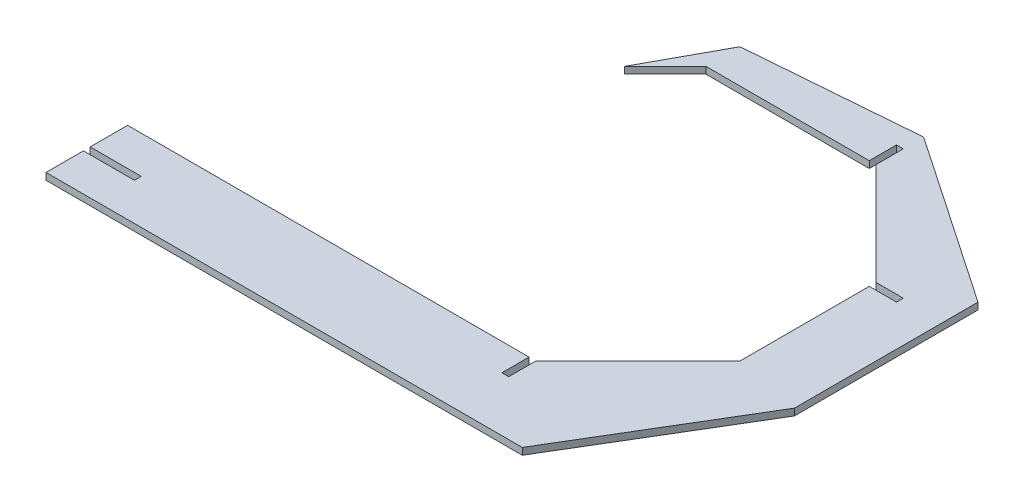
ISO-10303-21;
HEADER;
FILE_DESCRIPTION(('STEP AP214'),'2;1');
FILE_NAME('part.step','',(''),(''),'','','');
FILE_SCHEMA(('AUTOMOTIVE_DESIGN { 1 0 10303 214 1 1 1 1 }'));
ENDSEC;
DATA;
#1=APPLICATION_CONTEXT('core data for automotive mechanical design processes');
#2=APPLICATION_PROTOCOL_DEFINITION('international standard','automotive_design',2000,#1);
#3=PRODUCT_CONTEXT('',#1,'mechanical');
#4=PRODUCT('Part','Part','',(#3));
#5=PRODUCT_RELATED_PRODUCT_CATEGORY('part','',(#4));
#6=PRODUCT_DEFINITION_FORMATION('','',#4);
#7=PRODUCT_DEFINITION_CONTEXT('part definition',#1,'design');
#8=PRODUCT_DEFINITION('design','',#6,#7);
#9=PRODUCT_DEFINITION_SHAPE('','',#8);
#10=(LENGTH_UNIT() NAMED_UNIT(*) SI_UNIT(.MILLI.,.METRE.));
#11=(NAMED_UNIT(*) PLANE_ANGLE_UNIT() SI_UNIT($,.RADIAN.));
#12=(NAMED_UNIT(*) SI_UNIT($,.STERADIAN.) SOLID_ANGLE_UNIT());
#13=UNCERTAINTY_MEASURE_WITH_UNIT(LENGTH_MEASURE(1.E-05),#10,'distance_accuracy_value','');
#14=(GEOMETRIC_REPRESENTATION_CONTEXT(3) GLOBAL_UNCERTAINTY_ASSIGNED_CONTEXT((#13)) GLOBAL_UNIT_ASSIGNED_CONTEXT((#10,
#11,#12)) REPRESENTATION_CONTEXT('',''));
#15=CARTESIAN_POINT('',(0.,0.,0.));
#16=DIRECTION('',(0.,0.,1.));
#17=DIRECTION('',(1.,0.,0.));
#18=AXIS2_PLACEMENT_3D('',#15,#16,#17);
#19=CARTESIAN_POINT('',(0.,2.54,0.));
#20=DIRECTION('',(1.,0.,0.));
#21=DIRECTION('',(0.,0.,-1.));
#22=AXIS2_PLACEMENT_3D('',#19,#20,#21);
#23=PLANE('',#22);
#24=DIRECTION('',(0.,0.,1.));
#25=VECTOR('',#24,1.);
#26=CARTESIAN_POINT('',(0.,0.,0.));
#27=LINE('',#26,#25);
#28=CARTESIAN_POINT('',(0.,0.,0.));
#29=VERTEX_POINT('',#28);
#30=CARTESIAN_POINT('',(0.,0.,13.97));
#31=VERTEX_POINT('',#30);
#32=EDGE_CURVE('E345',#29,#31,#27,.T.);
#33=ORIENTED_EDGE('',*,*,#32,.T.);
#34=DIRECTION('',(0.,1.,0.));
#35=VECTOR('',#34,1.);
#36=CARTESIAN_POINT('',(0.,0.,13.97));
#37=LINE('',#36,#35);
#38=CARTESIAN_POINT('',(0.,2.54,13.97));
#39=VERTEX_POINT('',#38);
#40=EDGE_CURVE('E301',#31,#39,#37,.T.);
#41=ORIENTED_EDGE('',*,*,#40,.T.);
#42=DIRECTION('',(0.,0.,1.));
#43=VECTOR('',#42,1.);
#44=CARTESIAN_POINT('',(0.,2.54,0.));
#45=LINE('',#44,#43);
#46=CARTESIAN_POINT('',(0.,2.54,0.));
#47=VERTEX_POINT('',#46);
#48=EDGE_CURVE('E314',#47,#39,#45,.T.);
#49=ORIENTED_EDGE('',*,*,#48,.F.);
#50=DIRECTION('',(0.,-1.,0.));
#51=VECTOR('',#50,1.);
#52=CARTESIAN_POINT('',(0.,2.54,0.));
#53=LINE('',#52,#51);
#54=EDGE_CURVE('E11',#47,#29,#53,.T.);
#55=ORIENTED_EDGE('',*,*,#54,.T.);
#56=EDGE_LOOP('',(#33,#41,#49,#55));
#57=FACE_BOUND('',#56,.T.);
#58=ADVANCED_FACE('F33',(#57),#23,.F.);
#59=CARTESIAN_POINT('',(0.,2.54,0.));
#60=DIRECTION('',(0.,0.,1.));
#61=DIRECTION('',(1.,0.,0.));
#62=AXIS2_PLACEMENT_3D('',#59,#60,#61);
#63=PLANE('',#62);
#64=DIRECTION('',(-1.,0.,0.));
#65=VECTOR('',#64,1.);
#66=CARTESIAN_POINT('',(0.,2.54,0.));
#67=LINE('',#66,#65);
#68=CARTESIAN_POINT('',(149.86,2.54,0.));
#69=VERTEX_POINT('',#68);
#70=EDGE_CURVE('E310',#69,#47,#67,.T.);
#71=ORIENTED_EDGE('',*,*,#70,.F.);
#72=DIRECTION('',(0.,1.,0.));
#73=VECTOR('',#72,1.);
#74=CARTESIAN_POINT('',(149.86,0.,0.));
#75=LINE('',#74,#73);
#76=CARTESIAN_POINT('',(149.86,0.,0.));
#77=VERTEX_POINT('',#76);
#78=EDGE_CURVE('E271',#77,#69,#75,.T.);
#79=ORIENTED_EDGE('',*,*,#78,.F.);
#80=DIRECTION('',(-1.,0.,0.));
#81=VECTOR('',#80,1.);
#82=CARTESIAN_POINT('',(0.,0.,0.));
#83=LINE('',#82,#81);
#84=EDGE_CURVE('E304',#77,#29,#83,.T.);
#85=ORIENTED_EDGE('',*,*,#84,.T.);
#86=ORIENTED_EDGE('',*,*,#54,.F.);
#87=EDGE_LOOP('',(#71,#79,#85,#86));
#88=FACE_BOUND('',#87,.T.);
#89=ADVANCED_FACE('F35',(#88),#63,.F.);
#90=CARTESIAN_POINT('',(0.,2.54,16.51));
#91=VERTEX_POINT('',#90);
#92=CARTESIAN_POINT('',(0.,2.54,30.48));
#93=VERTEX_POINT('',#92);
#94=EDGE_CURVE('E312',#91,#93,#45,.T.);
#95=ORIENTED_EDGE('',*,*,#94,.F.);
#96=DIRECTION('',(0.,1.,0.));
#97=VECTOR('',#96,1.);
#98=CARTESIAN_POINT('',(0.,0.,16.51));
#99=LINE('',#98,#97);
#100=CARTESIAN_POINT('',(0.,0.,16.51));
#101=VERTEX_POINT('',#100);
#102=EDGE_CURVE('E294',#101,#91,#99,.T.);
#103=ORIENTED_EDGE('',*,*,#102,.F.);
#104=CARTESIAN_POINT('',(0.,0.,30.48));
#105=VERTEX_POINT('',#104);
#106=EDGE_CURVE('E344',#101,#105,#27,.T.);
#107=ORIENTED_EDGE('',*,*,#106,.T.);
#108=DIRECTION('',(0.,-1.,0.));
#109=VECTOR('',#108,1.);
#110=CARTESIAN_POINT('',(0.,2.54,30.48));
#111=LINE('',#110,#109);
#112=EDGE_CURVE('E41',#93,#105,#111,.T.);
#113=ORIENTED_EDGE('',*,*,#112,.F.);
#114=EDGE_LOOP('',(#95,#103,#107,#113));
#115=FACE_BOUND('',#114,.T.);
#116=ADVANCED_FACE('F426',(#115),#23,.F.);
#117=CARTESIAN_POINT('',(0.,2.54,30.48));
#118=DIRECTION('',(0.,0.,-1.));
#119=DIRECTION('',(-1.,0.,0.));
#120=AXIS2_PLACEMENT_3D('',#117,#118,#119);
#121=PLANE('',#120);
#122=DIRECTION('',(1.,0.,0.));
#123=VECTOR('',#122,1.);
#124=CARTESIAN_POINT('',(0.,0.,30.48));
#125=LINE('',#124,#123);
#126=CARTESIAN_POINT('',(177.8,0.,30.48));
#127=VERTEX_POINT('',#126);
#128=EDGE_CURVE('E348',#105,#127,#125,.T.);
#129=ORIENTED_EDGE('',*,*,#128,.T.);
#130=DIRECTION('',(0.,-1.,0.));
#131=VECTOR('',#130,1.);
#132=CARTESIAN_POINT('',(177.8,2.54,30.48));
#133=LINE('',#132,#131);
#134=CARTESIAN_POINT('',(177.8,2.54,30.48));
#135=VERTEX_POINT('',#134);
#136=EDGE_CURVE('E396',#135,#127,#133,.T.);
#137=ORIENTED_EDGE('',*,*,#136,.F.);
#138=DIRECTION('',(1.,0.,0.));
#139=VECTOR('',#138,1.);
#140=CARTESIAN_POINT('',(0.,2.54,30.48));
#141=LINE('',#140,#139);
#142=EDGE_CURVE('E317',#93,#135,#141,.T.);
#143=ORIENTED_EDGE('',*,*,#142,.F.);
#144=ORIENTED_EDGE('',*,*,#112,.T.);
#145=EDGE_LOOP('',(#129,#137,#143,#144));
#146=FACE_BOUND('',#145,.T.);
#147=ADVANCED_FACE('F403',(#146),#121,.F.);
#148=CARTESIAN_POINT('',(215.9,2.54,-33.02));
#149=DIRECTION('',(-0.857492925712544,0.,-0.514495755427526));
#150=DIRECTION('',(-0.514495755427526,0.,0.857492925712544));
#151=AXIS2_PLACEMENT_3D('',#148,#149,#150);
#152=PLANE('',#151);
#153=DIRECTION('',(0.514495755427526,0.,-0.857492925712544));
#154=VECTOR('',#153,1.);
#155=CARTESIAN_POINT('',(215.9,0.,-33.02));
#156=LINE('',#155,#154);
#157=CARTESIAN_POINT('',(215.9,0.,-33.02));
#158=VERTEX_POINT('',#157);
#159=EDGE_CURVE('E350',#127,#158,#156,.T.);
#160=ORIENTED_EDGE('',*,*,#159,.T.);
#161=DIRECTION('',(0.,-1.,0.));
#162=VECTOR('',#161,1.);
#163=CARTESIAN_POINT('',(215.9,2.54,-33.02));
#164=LINE('',#163,#162);
#165=CARTESIAN_POINT('',(215.9,2.54,-33.02));
#166=VERTEX_POINT('',#165);
#167=EDGE_CURVE('E393',#166,#158,#164,.T.);
#168=ORIENTED_EDGE('',*,*,#167,.F.);
#169=DIRECTION('',(0.514495755427526,0.,-0.857492925712544));
#170=VECTOR('',#169,1.);
#171=CARTESIAN_POINT('',(215.9,2.54,-33.02));
#172=LINE('',#171,#170);
#173=EDGE_CURVE('E319',#135,#166,#172,.T.);
#174=ORIENTED_EDGE('',*,*,#173,.F.);
#175=ORIENTED_EDGE('',*,*,#136,.T.);
#176=EDGE_LOOP('',(#160,#168,#174,#175));
#177=FACE_BOUND('',#176,.T.);
#178=ADVANCED_FACE('F413',(#177),#152,.F.);
#179=CARTESIAN_POINT('',(215.9,2.54,-101.555269232689));
#180=DIRECTION('',(-1.,0.,0.));
#181=DIRECTION('',(0.,0.,1.));
#182=AXIS2_PLACEMENT_3D('',#179,#180,#181);
#183=PLANE('',#182);
#184=DIRECTION('',(0.,0.,-1.));
#185=VECTOR('',#184,1.);
#186=CARTESIAN_POINT('',(215.9,0.,-101.555269232689));
#187=LINE('',#186,#185);
#188=CARTESIAN_POINT('',(215.9,0.,-101.555269232689));
#189=VERTEX_POINT('',#188);
#190=EDGE_CURVE('E352',#158,#189,#187,.T.);
#191=ORIENTED_EDGE('',*,*,#190,.T.);
#192=DIRECTION('',(0.,-1.,0.));
#193=VECTOR('',#192,1.);
#194=CARTESIAN_POINT('',(215.9,2.54,-101.555269232689));
#195=LINE('',#194,#193);
#196=CARTESIAN_POINT('',(215.9,2.54,-101.555269232689));
#197=VERTEX_POINT('',#196);
#198=EDGE_CURVE('E390',#197,#189,#195,.T.);
#199=ORIENTED_EDGE('',*,*,#198,.F.);
#200=DIRECTION('',(0.,0.,-1.));
#201=VECTOR('',#200,1.);
#202=CARTESIAN_POINT('',(215.9,2.54,-101.555269232689));
#203=LINE('',#202,#201);
#204=EDGE_CURVE('E321',#166,#197,#203,.T.);
#205=ORIENTED_EDGE('',*,*,#204,.F.);
#206=ORIENTED_EDGE('',*,*,#167,.T.);
#207=EDGE_LOOP('',(#191,#199,#205,#206));
#208=FACE_BOUND('',#207,.T.);
#209=ADVANCED_FACE('F417',(#208),#183,.F.);
#210=CARTESIAN_POINT('',(152.4,2.54,-144.78));
#211=DIRECTION('',(-0.562708146881539,0.,0.826655636545922));
#212=DIRECTION('',(0.826655636545922,0.,0.562708146881539));
#213=AXIS2_PLACEMENT_3D('',#210,#211,#212);
#214=PLANE('',#213);
#215=DIRECTION('',(-0.826655636545922,0.,-0.562708146881539));
#216=VECTOR('',#215,1.);
#217=CARTESIAN_POINT('',(152.4,0.,-144.78));
#218=LINE('',#217,#216);
#219=CARTESIAN_POINT('',(152.4,0.,-144.78));
#220=VERTEX_POINT('',#219);
#221=EDGE_CURVE('E354',#189,#220,#218,.T.);
#222=ORIENTED_EDGE('',*,*,#221,.T.);
#223=DIRECTION('',(0.,-1.,0.));
#224=VECTOR('',#223,1.);
#225=CARTESIAN_POINT('',(152.4,2.54,-144.78));
#226=LINE('',#225,#224);
#227=CARTESIAN_POINT('',(152.4,2.54,-144.78));
#228=VERTEX_POINT('',#227);
#229=EDGE_CURVE('E387',#228,#220,#226,.T.);
#230=ORIENTED_EDGE('',*,*,#229,.F.);
#231=DIRECTION('',(-0.826655636545922,0.,-0.562708146881539));
#232=VECTOR('',#231,1.);
#233=CARTESIAN_POINT('',(152.4,2.54,-144.78));
#234=LINE('',#233,#232);
#235=EDGE_CURVE('E323',#197,#228,#234,.T.);
#236=ORIENTED_EDGE('',*,*,#235,.F.);
#237=ORIENTED_EDGE('',*,*,#198,.T.);
#238=EDGE_LOOP('',(#222,#230,#236,#237));
#239=FACE_BOUND('',#238,.T.);
#240=ADVANCED_FACE('F501',(#239),#214,.F.);
#241=CARTESIAN_POINT('',(88.9,2.54,-139.7));
#242=DIRECTION('',(0.07974522228289,0.,0.996815278536125));
#243=DIRECTION('',(0.996815278536125,0.,-0.07974522228289));
#244=AXIS2_PLACEMENT_3D('',#241,#242,#243);
#245=PLANE('',#244);
#246=DIRECTION('',(-0.996815278536125,0.,0.07974522228289));
#247=VECTOR('',#246,1.);
#248=CARTESIAN_POINT('',(88.9,0.,-139.7));
#249=LINE('',#248,#247);
#250=CARTESIAN_POINT('',(88.9,0.,-139.7));
#251=VERTEX_POINT('',#250);
#252=EDGE_CURVE('E356',#220,#251,#249,.T.);
#253=ORIENTED_EDGE('',*,*,#252,.T.);
#254=DIRECTION('',(0.,-1.,0.));
#255=VECTOR('',#254,1.);
#256=CARTESIAN_POINT('',(88.9,2.54,-139.7));
#257=LINE('',#256,#255);
#258=CARTESIAN_POINT('',(88.9,2.54,-139.7));
#259=VERTEX_POINT('',#258);
#260=EDGE_CURVE('E384',#259,#251,#257,.T.);
#261=ORIENTED_EDGE('',*,*,#260,.F.);
#262=DIRECTION('',(-0.996815278536125,0.,0.07974522228289));
#263=VECTOR('',#262,1.);
#264=CARTESIAN_POINT('',(88.9,2.54,-139.7));
#265=LINE('',#264,#263);
#266=EDGE_CURVE('E325',#228,#259,#265,.T.);
#267=ORIENTED_EDGE('',*,*,#266,.F.);
#268=ORIENTED_EDGE('',*,*,#229,.T.);
#269=EDGE_LOOP('',(#253,#261,#267,#268));
#270=FACE_BOUND('',#269,.T.);
#271=ADVANCED_FACE('F499',(#270),#245,.F.);
#272=CARTESIAN_POINT('',(73.66,2.54,-111.76));
#273=DIRECTION('',(0.877895572914384,0.,0.478852130680573));
#274=DIRECTION('',(0.478852130680573,0.,-0.877895572914385));
#275=AXIS2_PLACEMENT_3D('',#272,#273,#274);
#276=PLANE('',#275);
#277=DIRECTION('',(-0.478852130680573,0.,0.877895572914385));
#278=VECTOR('',#277,1.);
#279=CARTESIAN_POINT('',(73.66,0.,-111.76));
#280=LINE('',#279,#278);
#281=CARTESIAN_POINT('',(73.66,0.,-111.76));
#282=VERTEX_POINT('',#281);
#283=EDGE_CURVE('E358',#251,#282,#280,.T.);
#284=ORIENTED_EDGE('',*,*,#283,.T.);
#285=DIRECTION('',(0.,-1.,0.));
#286=VECTOR('',#285,1.);
#287=CARTESIAN_POINT('',(73.66,2.54,-111.76));
#288=LINE('',#287,#286);
#289=CARTESIAN_POINT('',(73.66,2.54,-111.76));
#290=VERTEX_POINT('',#289);
#291=EDGE_CURVE('E381',#290,#282,#288,.T.);
#292=ORIENTED_EDGE('',*,*,#291,.F.);
#293=DIRECTION('',(-0.478852130680573,0.,0.877895572914385));
#294=VECTOR('',#293,1.);
#295=CARTESIAN_POINT('',(73.66,2.54,-111.76));
#296=LINE('',#295,#294);
#297=EDGE_CURVE('E327',#259,#290,#296,.T.);
#298=ORIENTED_EDGE('',*,*,#297,.F.);
#299=ORIENTED_EDGE('',*,*,#260,.T.);
#300=EDGE_LOOP('',(#284,#292,#298,#299));
#301=FACE_BOUND('',#300,.T.);
#302=ADVANCED_FACE('F495',(#301),#276,.F.);
#303=CARTESIAN_POINT('',(88.9,2.54,-127.));
#304=DIRECTION('',(-0.707106781186548,0.,-0.707106781186547));
#305=DIRECTION('',(-0.707106781186547,0.,0.707106781186548));
#306=AXIS2_PLACEMENT_3D('',#303,#304,#305);
#307=PLANE('',#306);
#308=DIRECTION('',(0.707106781186547,0.,-0.707106781186549));
#309=VECTOR('',#308,1.);
#310=CARTESIAN_POINT('',(88.9,0.,-127.));
#311=LINE('',#310,#309);
#312=CARTESIAN_POINT('',(88.9,0.,-127.));
#313=VERTEX_POINT('',#312);
#314=EDGE_CURVE('E360',#282,#313,#311,.T.);
#315=ORIENTED_EDGE('',*,*,#314,.T.);
#316=DIRECTION('',(0.,-1.,0.));
#317=VECTOR('',#316,1.);
#318=CARTESIAN_POINT('',(88.9,2.54,-127.));
#319=LINE('',#318,#317);
#320=CARTESIAN_POINT('',(88.9,2.54,-127.));
#321=VERTEX_POINT('',#320);
#322=EDGE_CURVE('E378',#321,#313,#319,.T.);
#323=ORIENTED_EDGE('',*,*,#322,.F.);
#324=DIRECTION('',(0.707106781186547,0.,-0.707106781186549));
#325=VECTOR('',#324,1.);
#326=CARTESIAN_POINT('',(88.9,2.54,-127.));
#327=LINE('',#326,#325);
#328=EDGE_CURVE('E329',#290,#321,#327,.T.);
#329=ORIENTED_EDGE('',*,*,#328,.F.);
#330=ORIENTED_EDGE('',*,*,#291,.T.);
#331=EDGE_LOOP('',(#315,#323,#329,#330));
#332=FACE_BOUND('',#331,.T.);
#333=ADVANCED_FACE('F490',(#332),#307,.F.);
#334=CARTESIAN_POINT('',(152.4,2.54,-127.));
#335=DIRECTION('',(0.,0.,-1.));
#336=DIRECTION('',(-1.,0.,0.));
#337=AXIS2_PLACEMENT_3D('',#334,#335,#336);
#338=PLANE('',#337);
#339=DIRECTION('',(1.,0.,0.));
#340=VECTOR('',#339,1.);
#341=CARTESIAN_POINT('',(152.4,0.,-127.));
#342=LINE('',#341,#340);
#343=CARTESIAN_POINT('',(149.86,0.,-127.));
#344=VERTEX_POINT('',#343);
#345=EDGE_CURVE('E362',#313,#344,#342,.T.);
#346=ORIENTED_EDGE('',*,*,#345,.T.);
#347=DIRECTION('',(0.,1.,0.));
#348=VECTOR('',#347,1.);
#349=CARTESIAN_POINT('',(149.86,0.,-127.));
#350=LINE('',#349,#348);
#351=CARTESIAN_POINT('',(149.86,2.54,-127.));
#352=VERTEX_POINT('',#351);
#353=EDGE_CURVE('E236',#344,#352,#350,.T.);
#354=ORIENTED_EDGE('',*,*,#353,.T.);
#355=DIRECTION('',(1.,0.,0.));
#356=VECTOR('',#355,1.);
#357=CARTESIAN_POINT('',(152.4,2.54,-127.));
#358=LINE('',#357,#356);
#359=EDGE_CURVE('E331',#321,#352,#358,.T.);
#360=ORIENTED_EDGE('',*,*,#359,.F.);
#361=ORIENTED_EDGE('',*,*,#322,.T.);
#362=EDGE_LOOP('',(#346,#354,#360,#361));
#363=FACE_BOUND('',#362,.T.);
#364=ADVANCED_FACE('F483',(#363),#338,.F.);
#365=CARTESIAN_POINT('',(190.5,2.54,-88.9));
#366=DIRECTION('',(0.707106781186547,0.,-0.707106781186548));
#367=DIRECTION('',(-0.707106781186548,0.,-0.707106781186547));
#368=AXIS2_PLACEMENT_3D('',#365,#366,#367);
#369=PLANE('',#368);
#370=DIRECTION('',(0.707106781186548,0.,0.707106781186547));
#371=VECTOR('',#370,1.);
#372=CARTESIAN_POINT('',(190.5,0.,-88.9));
#373=LINE('',#372,#371);
#374=CARTESIAN_POINT('',(152.4,0.,-127.));
#375=VERTEX_POINT('',#374);
#376=CARTESIAN_POINT('',(190.5,0.,-88.9));
#377=VERTEX_POINT('',#376);
#378=EDGE_CURVE('E227',#375,#377,#373,.T.);
#379=ORIENTED_EDGE('',*,*,#378,.T.);
#380=DIRECTION('',(0.,-1.,0.));
#381=VECTOR('',#380,1.);
#382=CARTESIAN_POINT('',(190.5,2.54,-88.9));
#383=LINE('',#382,#381);
#384=CARTESIAN_POINT('',(190.5,2.54,-88.9));
#385=VERTEX_POINT('',#384);
#386=EDGE_CURVE('E374',#385,#377,#383,.T.);
#387=ORIENTED_EDGE('',*,*,#386,.F.);
#388=DIRECTION('',(0.707106781186548,0.,0.707106781186547));
#389=VECTOR('',#388,1.);
#390=CARTESIAN_POINT('',(190.5,2.54,-88.9));
#391=LINE('',#390,#389);
#392=CARTESIAN_POINT('',(152.4,2.54,-127.));
#393=VERTEX_POINT('',#392);
#394=EDGE_CURVE('E334',#393,#385,#391,.T.);
#395=ORIENTED_EDGE('',*,*,#394,.F.);
#396=DIRECTION('',(0.,-1.,0.));
#397=VECTOR('',#396,1.);
#398=CARTESIAN_POINT('',(152.4,2.54,-127.));
#399=LINE('',#398,#397);
#400=EDGE_CURVE('E376',#393,#375,#399,.T.);
#401=ORIENTED_EDGE('',*,*,#400,.T.);
#402=EDGE_LOOP('',(#379,#387,#395,#401));
#403=FACE_BOUND('',#402,.T.);
#404=ADVANCED_FACE('F478',(#403),#369,.F.);
#405=CARTESIAN_POINT('',(190.5,2.54,-38.1));
#406=DIRECTION('',(1.,0.,0.));
#407=DIRECTION('',(0.,0.,-1.));
#408=AXIS2_PLACEMENT_3D('',#405,#406,#407);
#409=PLANE('',#408);
#410=DIRECTION('',(0.,0.,1.));
#411=VECTOR('',#410,1.);
#412=CARTESIAN_POINT('',(190.5,2.54,-38.1));
#413=LINE('',#412,#411);
#414=CARTESIAN_POINT('',(190.5,2.54,-86.36));
#415=VERTEX_POINT('',#414);
#416=CARTESIAN_POINT('',(190.5,2.54,-38.1));
#417=VERTEX_POINT('',#416);
#418=EDGE_CURVE('E337',#415,#417,#413,.T.);
#419=ORIENTED_EDGE('',*,*,#418,.F.);
#420=DIRECTION('',(0.,1.,0.));
#421=VECTOR('',#420,1.);
#422=CARTESIAN_POINT('',(190.5,0.,-86.36));
#423=LINE('',#422,#421);
#424=CARTESIAN_POINT('',(190.5,0.,-86.36));
#425=VERTEX_POINT('',#424);
#426=EDGE_CURVE('E248',#425,#415,#423,.T.);
#427=ORIENTED_EDGE('',*,*,#426,.F.);
#428=DIRECTION('',(0.,0.,1.));
#429=VECTOR('',#428,1.);
#430=CARTESIAN_POINT('',(190.5,0.,-38.1));
#431=LINE('',#430,#429);
#432=CARTESIAN_POINT('',(190.5,0.,-38.1));
#433=VERTEX_POINT('',#432);
#434=EDGE_CURVE('E366',#425,#433,#431,.T.);
#435=ORIENTED_EDGE('',*,*,#434,.T.);
#436=DIRECTION('',(0.,-1.,0.));
#437=VECTOR('',#436,1.);
#438=CARTESIAN_POINT('',(190.5,2.54,-38.1));
#439=LINE('',#438,#437);
#440=EDGE_CURVE('E371',#417,#433,#439,.T.);
#441=ORIENTED_EDGE('',*,*,#440,.F.);
#442=EDGE_LOOP('',(#419,#427,#435,#441));
#443=FACE_BOUND('',#442,.T.);
#444=ADVANCED_FACE('F464',(#443),#409,.F.);
#445=CARTESIAN_POINT('',(152.4,2.54,0.));
#446=DIRECTION('',(0.707106781186548,0.,0.707106781186548));
#447=DIRECTION('',(0.707106781186548,0.,-0.707106781186548));
#448=AXIS2_PLACEMENT_3D('',#445,#446,#447);
#449=PLANE('',#448);
#450=DIRECTION('',(-0.707106781186547,0.,0.707106781186547));
#451=VECTOR('',#450,1.);
#452=CARTESIAN_POINT('',(152.4,0.,0.));
#453=LINE('',#452,#451);
#454=CARTESIAN_POINT('',(152.4,0.,0.));
#455=VERTEX_POINT('',#454);
#456=EDGE_CURVE('E313',#433,#455,#453,.T.);
#457=ORIENTED_EDGE('',*,*,#456,.T.);
#458=DIRECTION('',(0.,-1.,0.));
#459=VECTOR('',#458,1.);
#460=CARTESIAN_POINT('',(152.4,2.54,0.));
#461=LINE('',#460,#459);
#462=CARTESIAN_POINT('',(152.4,2.54,0.));
#463=VERTEX_POINT('',#462);
#464=EDGE_CURVE('E342',#463,#455,#461,.T.);
#465=ORIENTED_EDGE('',*,*,#464,.F.);
#466=DIRECTION('',(-0.707106781186547,0.,0.707106781186547));
#467=VECTOR('',#466,1.);
#468=CARTESIAN_POINT('',(152.4,2.54,0.));
#469=LINE('',#468,#467);
#470=EDGE_CURVE('E339',#417,#463,#469,.T.);
#471=ORIENTED_EDGE('',*,*,#470,.F.);
#472=ORIENTED_EDGE('',*,*,#440,.T.);
#473=EDGE_LOOP('',(#457,#465,#471,#472));
#474=FACE_BOUND('',#473,.T.);
#475=ADVANCED_FACE('F459',(#474),#449,.F.);
#476=CARTESIAN_POINT('',(0.,2.54,0.));
#477=DIRECTION('',(0.,1.,0.));
#478=DIRECTION('',(0.,0.,1.));
#479=AXIS2_PLACEMENT_3D('',#476,#477,#478);
#480=PLANE('',#479);
#481=DIRECTION('',(0.,0.,-1.));
#482=VECTOR('',#481,1.);
#483=CARTESIAN_POINT('',(152.4,2.54,-127.));
#484=LINE('',#483,#482);
#485=CARTESIAN_POINT('',(152.4,2.54,-137.16));
#486=VERTEX_POINT('',#485);
#487=EDGE_CURVE('E212',#393,#486,#484,.T.);
#488=ORIENTED_EDGE('',*,*,#487,.F.);
#489=ORIENTED_EDGE('',*,*,#394,.T.);
#490=DIRECTION('',(-1.,0.,0.));
#491=VECTOR('',#490,1.);
#492=CARTESIAN_POINT('',(190.5,2.54,-88.9));
#493=LINE('',#492,#491);
#494=CARTESIAN_POINT('',(200.66,2.54,-88.9));
#495=VERTEX_POINT('',#494);
#496=EDGE_CURVE('E244',#495,#385,#493,.T.);
#497=ORIENTED_EDGE('',*,*,#496,.F.);
#498=DIRECTION('',(0.,0.,-1.));
#499=VECTOR('',#498,1.);
#500=CARTESIAN_POINT('',(200.66,2.54,-88.9));
#501=LINE('',#500,#499);
#502=CARTESIAN_POINT('',(200.66,2.54,-86.36));
#503=VERTEX_POINT('',#502);
#504=EDGE_CURVE('E251',#503,#495,#501,.T.);
#505=ORIENTED_EDGE('',*,*,#504,.F.);
#506=DIRECTION('',(1.,0.,0.));
#507=VECTOR('',#506,1.);
#508=CARTESIAN_POINT('',(190.5,2.54,-86.36));
#509=LINE('',#508,#507);
#510=EDGE_CURVE('E239',#415,#503,#509,.T.);
#511=ORIENTED_EDGE('',*,*,#510,.F.);
#512=ORIENTED_EDGE('',*,*,#418,.T.);
#513=ORIENTED_EDGE('',*,*,#470,.T.);
#514=DIRECTION('',(0.,0.,-1.));
#515=VECTOR('',#514,1.);
#516=CARTESIAN_POINT('',(152.4,2.54,0.));
#517=LINE('',#516,#515);
#518=CARTESIAN_POINT('',(152.4,2.54,10.16));
#519=VERTEX_POINT('',#518);
#520=EDGE_CURVE('E257',#519,#463,#517,.T.);
#521=ORIENTED_EDGE('',*,*,#520,.F.);
#522=DIRECTION('',(1.,0.,0.));
#523=VECTOR('',#522,1.);
#524=CARTESIAN_POINT('',(152.4,2.54,10.16));
#525=LINE('',#524,#523);
#526=CARTESIAN_POINT('',(149.86,2.54,10.16));
#527=VERTEX_POINT('',#526);
#528=EDGE_CURVE('E265',#527,#519,#525,.T.);
#529=ORIENTED_EDGE('',*,*,#528,.F.);
#530=DIRECTION('',(0.,0.,1.));
#531=VECTOR('',#530,1.);
#532=CARTESIAN_POINT('',(149.86,2.54,0.));
#533=LINE('',#532,#531);
#534=EDGE_CURVE('E273',#69,#527,#533,.T.);
#535=ORIENTED_EDGE('',*,*,#534,.F.);
#536=ORIENTED_EDGE('',*,*,#70,.T.);
#537=ORIENTED_EDGE('',*,*,#48,.T.);
#538=DIRECTION('',(-1.,0.,0.));
#539=VECTOR('',#538,1.);
#540=CARTESIAN_POINT('',(0.,2.54,13.97));
#541=LINE('',#540,#539);
#542=CARTESIAN_POINT('',(19.05,2.54,13.97));
#543=VERTEX_POINT('',#542);
#544=EDGE_CURVE('E288',#543,#39,#541,.T.);
#545=ORIENTED_EDGE('',*,*,#544,.F.);
#546=DIRECTION('',(0.,0.,-1.));
#547=VECTOR('',#546,1.);
#548=CARTESIAN_POINT('',(19.05,2.54,13.97));
#549=LINE('',#548,#547);
#550=CARTESIAN_POINT('',(19.05,2.54,16.51));
#551=VERTEX_POINT('',#550);
#552=EDGE_CURVE('E297',#551,#543,#549,.T.);
#553=ORIENTED_EDGE('',*,*,#552,.F.);
#554=DIRECTION('',(1.,0.,0.));
#555=VECTOR('',#554,1.);
#556=CARTESIAN_POINT('',(0.,2.54,16.51));
#557=LINE('',#556,#555);
#558=EDGE_CURVE('E280',#91,#551,#557,.T.);
#559=ORIENTED_EDGE('',*,*,#558,.F.);
#560=ORIENTED_EDGE('',*,*,#94,.T.);
#561=ORIENTED_EDGE('',*,*,#142,.T.);
#562=ORIENTED_EDGE('',*,*,#173,.T.);
#563=ORIENTED_EDGE('',*,*,#204,.T.);
#564=ORIENTED_EDGE('',*,*,#235,.T.);
#565=ORIENTED_EDGE('',*,*,#266,.T.);
#566=ORIENTED_EDGE('',*,*,#297,.T.);
#567=ORIENTED_EDGE('',*,*,#328,.T.);
#568=ORIENTED_EDGE('',*,*,#359,.T.);
#569=DIRECTION('',(0.,0.,1.));
#570=VECTOR('',#569,1.);
#571=CARTESIAN_POINT('',(149.86,2.54,-127.));
#572=LINE('',#571,#570);
#573=CARTESIAN_POINT('',(149.86,2.54,-137.16));
#574=VERTEX_POINT('',#573);
#575=EDGE_CURVE('E228',#574,#352,#572,.T.);
#576=ORIENTED_EDGE('',*,*,#575,.F.);
#577=DIRECTION('',(-1.,0.,0.));
#578=VECTOR('',#577,1.);
#579=CARTESIAN_POINT('',(152.4,2.54,-137.16));
#580=LINE('',#579,#578);
#581=EDGE_CURVE('E230',#486,#574,#580,.T.);
#582=ORIENTED_EDGE('',*,*,#581,.F.);
#583=EDGE_LOOP('',(#488,#489,#497,#505,#511,#512,#513,#521,#529,#535,#536,#537,#545,#553,#559,
#560,#561,#562,#563,#564,#565,#566,#567,#568,#576,#582));
#584=FACE_BOUND('',#583,.T.);
#585=ADVANCED_FACE('F421',(#584),#480,.T.);
#586=CARTESIAN_POINT('',(0.,0.,0.));
#587=DIRECTION('',(0.,1.,0.));
#588=DIRECTION('',(0.,0.,1.));
#589=AXIS2_PLACEMENT_3D('',#586,#587,#588);
#590=PLANE('',#589);
#591=ORIENTED_EDGE('',*,*,#378,.F.);
#592=DIRECTION('',(0.,0.,-1.));
#593=VECTOR('',#592,1.);
#594=CARTESIAN_POINT('',(152.4,0.,-127.));
#595=LINE('',#594,#593);
#596=CARTESIAN_POINT('',(152.4,0.,-137.16));
#597=VERTEX_POINT('',#596);
#598=EDGE_CURVE('E209',#375,#597,#595,.T.);
#599=ORIENTED_EDGE('',*,*,#598,.T.);
#600=DIRECTION('',(-1.,0.,0.));
#601=VECTOR('',#600,1.);
#602=CARTESIAN_POINT('',(152.4,0.,-137.16));
#603=LINE('',#602,#601);
#604=CARTESIAN_POINT('',(149.86,0.,-137.16));
#605=VERTEX_POINT('',#604);
#606=EDGE_CURVE('E219',#597,#605,#603,.T.);
#607=ORIENTED_EDGE('',*,*,#606,.T.);
#608=DIRECTION('',(0.,0.,1.));
#609=VECTOR('',#608,1.);
#610=CARTESIAN_POINT('',(149.86,0.,-127.));
#611=LINE('',#610,#609);
#612=EDGE_CURVE('E48',#605,#344,#611,.T.);
#613=ORIENTED_EDGE('',*,*,#612,.T.);
#614=ORIENTED_EDGE('',*,*,#345,.F.);
#615=ORIENTED_EDGE('',*,*,#314,.F.);
#616=ORIENTED_EDGE('',*,*,#283,.F.);
#617=ORIENTED_EDGE('',*,*,#252,.F.);
#618=ORIENTED_EDGE('',*,*,#221,.F.);
#619=ORIENTED_EDGE('',*,*,#190,.F.);
#620=ORIENTED_EDGE('',*,*,#159,.F.);
#621=ORIENTED_EDGE('',*,*,#128,.F.);
#622=ORIENTED_EDGE('',*,*,#106,.F.);
#623=DIRECTION('',(1.,0.,0.));
#624=VECTOR('',#623,1.);
#625=CARTESIAN_POINT('',(0.,0.,16.51));
#626=LINE('',#625,#624);
#627=CARTESIAN_POINT('',(19.05,0.,16.51));
#628=VERTEX_POINT('',#627);
#629=EDGE_CURVE('E284',#101,#628,#626,.T.);
#630=ORIENTED_EDGE('',*,*,#629,.T.);
#631=DIRECTION('',(0.,0.,-1.));
#632=VECTOR('',#631,1.);
#633=CARTESIAN_POINT('',(19.05,0.,13.97));
#634=LINE('',#633,#632);
#635=CARTESIAN_POINT('',(19.05,0.,13.97));
#636=VERTEX_POINT('',#635);
#637=EDGE_CURVE('E287',#628,#636,#634,.T.);
#638=ORIENTED_EDGE('',*,*,#637,.T.);
#639=DIRECTION('',(-1.,0.,0.));
#640=VECTOR('',#639,1.);
#641=CARTESIAN_POINT('',(0.,0.,13.97));
#642=LINE('',#641,#640);
#643=EDGE_CURVE('E291',#636,#31,#642,.T.);
#644=ORIENTED_EDGE('',*,*,#643,.T.);
#645=ORIENTED_EDGE('',*,*,#32,.F.);
#646=ORIENTED_EDGE('',*,*,#84,.F.);
#647=DIRECTION('',(0.,0.,1.));
#648=VECTOR('',#647,1.);
#649=CARTESIAN_POINT('',(149.86,0.,0.));
#650=LINE('',#649,#648);
#651=CARTESIAN_POINT('',(149.86,0.,10.16));
#652=VERTEX_POINT('',#651);
#653=EDGE_CURVE('E264',#77,#652,#650,.T.);
#654=ORIENTED_EDGE('',*,*,#653,.T.);
#655=DIRECTION('',(1.,0.,0.));
#656=VECTOR('',#655,1.);
#657=CARTESIAN_POINT('',(152.4,0.,10.16));
#658=LINE('',#657,#656);
#659=CARTESIAN_POINT('',(152.4,0.,10.16));
#660=VERTEX_POINT('',#659);
#661=EDGE_CURVE('E268',#652,#660,#658,.T.);
#662=ORIENTED_EDGE('',*,*,#661,.T.);
#663=DIRECTION('',(0.,0.,-1.));
#664=VECTOR('',#663,1.);
#665=CARTESIAN_POINT('',(152.4,0.,0.));
#666=LINE('',#665,#664);
#667=EDGE_CURVE('E261',#660,#455,#666,.T.);
#668=ORIENTED_EDGE('',*,*,#667,.T.);
#669=ORIENTED_EDGE('',*,*,#456,.F.);
#670=ORIENTED_EDGE('',*,*,#434,.F.);
#671=DIRECTION('',(1.,0.,0.));
#672=VECTOR('',#671,1.);
#673=CARTESIAN_POINT('',(190.5,0.,-86.36));
#674=LINE('',#673,#672);
#675=CARTESIAN_POINT('',(200.66,0.,-86.36));
#676=VERTEX_POINT('',#675);
#677=EDGE_CURVE('E241',#425,#676,#674,.T.);
#678=ORIENTED_EDGE('',*,*,#677,.T.);
#679=DIRECTION('',(0.,0.,-1.));
#680=VECTOR('',#679,1.);
#681=CARTESIAN_POINT('',(200.66,0.,-88.9));
#682=LINE('',#681,#680);
#683=CARTESIAN_POINT('',(200.66,0.,-88.9));
#684=VERTEX_POINT('',#683);
#685=EDGE_CURVE('E56',#676,#684,#682,.T.);
#686=ORIENTED_EDGE('',*,*,#685,.T.);
#687=DIRECTION('',(-1.,0.,0.));
#688=VECTOR('',#687,1.);
#689=CARTESIAN_POINT('',(190.5,0.,-88.9));
#690=LINE('',#689,#688);
#691=EDGE_CURVE('E246',#684,#377,#690,.T.);
#692=ORIENTED_EDGE('',*,*,#691,.T.);
#693=EDGE_LOOP('',(#591,#599,#607,#613,#614,#615,#616,#617,#618,#619,#620,#621,#622,#630,#638,
#644,#645,#646,#654,#662,#668,#669,#670,#678,#686,#692));
#694=FACE_BOUND('',#693,.T.);
#695=ADVANCED_FACE('F224',(#694),#590,.F.);
#696=CARTESIAN_POINT('',(0.,0.,13.97));
#697=DIRECTION('',(0.,0.,-1.));
#698=DIRECTION('',(-1.,0.,0.));
#699=AXIS2_PLACEMENT_3D('',#696,#697,#698);
#700=PLANE('',#699);
#701=ORIENTED_EDGE('',*,*,#544,.T.);
#702=ORIENTED_EDGE('',*,*,#40,.F.);
#703=ORIENTED_EDGE('',*,*,#643,.F.);
#704=DIRECTION('',(0.,1.,0.));
#705=VECTOR('',#704,1.);
#706=CARTESIAN_POINT('',(19.05,0.,13.97));
#707=LINE('',#706,#705);
#708=EDGE_CURVE('E305',#636,#543,#707,.T.);
#709=ORIENTED_EDGE('',*,*,#708,.T.);
#710=EDGE_LOOP('',(#701,#702,#703,#709));
#711=FACE_BOUND('',#710,.T.);
#712=ADVANCED_FACE('F436',(#711),#700,.F.);
#713=CARTESIAN_POINT('',(19.05,0.,13.97));
#714=DIRECTION('',(1.,0.,0.));
#715=DIRECTION('',(0.,0.,-1.));
#716=AXIS2_PLACEMENT_3D('',#713,#714,#715);
#717=PLANE('',#716);
#718=ORIENTED_EDGE('',*,*,#552,.T.);
#719=ORIENTED_EDGE('',*,*,#708,.F.);
#720=ORIENTED_EDGE('',*,*,#637,.F.);
#721=DIRECTION('',(0.,1.,0.));
#722=VECTOR('',#721,1.);
#723=CARTESIAN_POINT('',(19.05,0.,16.51));
#724=LINE('',#723,#722);
#725=EDGE_CURVE('E307',#628,#551,#724,.T.);
#726=ORIENTED_EDGE('',*,*,#725,.T.);
#727=EDGE_LOOP('',(#718,#719,#720,#726));
#728=FACE_BOUND('',#727,.T.);
#729=ADVANCED_FACE('F433',(#728),#717,.F.);
#730=CARTESIAN_POINT('',(0.,0.,16.51));
#731=DIRECTION('',(0.,0.,1.));
#732=DIRECTION('',(1.,0.,0.));
#733=AXIS2_PLACEMENT_3D('',#730,#731,#732);
#734=PLANE('',#733);
#735=ORIENTED_EDGE('',*,*,#558,.T.);
#736=ORIENTED_EDGE('',*,*,#725,.F.);
#737=ORIENTED_EDGE('',*,*,#629,.F.);
#738=ORIENTED_EDGE('',*,*,#102,.T.);
#739=EDGE_LOOP('',(#735,#736,#737,#738));
#740=FACE_BOUND('',#739,.T.);
#741=ADVANCED_FACE('F428',(#740),#734,.F.);
#742=CARTESIAN_POINT('',(152.4,0.,0.));
#743=DIRECTION('',(1.,0.,0.));
#744=DIRECTION('',(0.,0.,-1.));
#745=AXIS2_PLACEMENT_3D('',#742,#743,#744);
#746=PLANE('',#745);
#747=ORIENTED_EDGE('',*,*,#520,.T.);
#748=ORIENTED_EDGE('',*,*,#464,.T.);
#749=ORIENTED_EDGE('',*,*,#667,.F.);
#750=DIRECTION('',(0.,1.,0.));
#751=VECTOR('',#750,1.);
#752=CARTESIAN_POINT('',(152.4,0.,10.16));
#753=LINE('',#752,#751);
#754=EDGE_CURVE('E278',#660,#519,#753,.T.);
#755=ORIENTED_EDGE('',*,*,#754,.T.);
#756=EDGE_LOOP('',(#747,#748,#749,#755));
#757=FACE_BOUND('',#756,.T.);
#758=ADVANCED_FACE('F454',(#757),#746,.F.);
#759=CARTESIAN_POINT('',(152.4,0.,10.16));
#760=DIRECTION('',(0.,0.,1.));
#761=DIRECTION('',(1.,0.,0.));
#762=AXIS2_PLACEMENT_3D('',#759,#760,#761);
#763=PLANE('',#762);
#764=ORIENTED_EDGE('',*,*,#528,.T.);
#765=ORIENTED_EDGE('',*,*,#754,.F.);
#766=ORIENTED_EDGE('',*,*,#661,.F.);
#767=DIRECTION('',(0.,1.,0.));
#768=VECTOR('',#767,1.);
#769=CARTESIAN_POINT('',(149.86,0.,10.16));
#770=LINE('',#769,#768);
#771=EDGE_CURVE('E281',#652,#527,#770,.T.);
#772=ORIENTED_EDGE('',*,*,#771,.T.);
#773=EDGE_LOOP('',(#764,#765,#766,#772));
#774=FACE_BOUND('',#773,.T.);
#775=ADVANCED_FACE('F450',(#774),#763,.F.);
#776=CARTESIAN_POINT('',(149.86,0.,0.));
#777=DIRECTION('',(-1.,0.,0.));
#778=DIRECTION('',(0.,0.,1.));
#779=AXIS2_PLACEMENT_3D('',#776,#777,#778);
#780=PLANE('',#779);
#781=ORIENTED_EDGE('',*,*,#534,.T.);
#782=ORIENTED_EDGE('',*,*,#771,.F.);
#783=ORIENTED_EDGE('',*,*,#653,.F.);
#784=ORIENTED_EDGE('',*,*,#78,.T.);
#785=EDGE_LOOP('',(#781,#782,#783,#784));
#786=FACE_BOUND('',#785,.T.);
#787=ADVANCED_FACE('F448',(#786),#780,.F.);
#788=CARTESIAN_POINT('',(190.5,0.,-88.9));
#789=DIRECTION('',(0.,0.,-1.));
#790=DIRECTION('',(-1.,0.,0.));
#791=AXIS2_PLACEMENT_3D('',#788,#789,#790);
#792=PLANE('',#791);
#793=ORIENTED_EDGE('',*,*,#496,.T.);
#794=ORIENTED_EDGE('',*,*,#386,.T.);
#795=ORIENTED_EDGE('',*,*,#691,.F.);
#796=DIRECTION('',(0.,1.,0.));
#797=VECTOR('',#796,1.);
#798=CARTESIAN_POINT('',(200.66,0.,-88.9));
#799=LINE('',#798,#797);
#800=EDGE_CURVE('E255',#684,#495,#799,.T.);
#801=ORIENTED_EDGE('',*,*,#800,.T.);
#802=EDGE_LOOP('',(#793,#794,#795,#801));
#803=FACE_BOUND('',#802,.T.);
#804=ADVANCED_FACE('F476',(#803),#792,.F.);
#805=CARTESIAN_POINT('',(200.66,0.,-88.9));
#806=DIRECTION('',(1.,0.,0.));
#807=DIRECTION('',(0.,0.,-1.));
#808=AXIS2_PLACEMENT_3D('',#805,#806,#807);
#809=PLANE('',#808);
#810=ORIENTED_EDGE('',*,*,#504,.T.);
#811=ORIENTED_EDGE('',*,*,#800,.F.);
#812=ORIENTED_EDGE('',*,*,#685,.F.);
#813=DIRECTION('',(0.,1.,0.));
#814=VECTOR('',#813,1.);
#815=CARTESIAN_POINT('',(200.66,0.,-86.36));
#816=LINE('',#815,#814);
#817=EDGE_CURVE('E258',#676,#503,#816,.T.);
#818=ORIENTED_EDGE('',*,*,#817,.T.);
#819=EDGE_LOOP('',(#810,#811,#812,#818));
#820=FACE_BOUND('',#819,.T.);
#821=ADVANCED_FACE('F470',(#820),#809,.F.);
#822=CARTESIAN_POINT('',(190.5,0.,-86.36));
#823=DIRECTION('',(0.,0.,1.));
#824=DIRECTION('',(1.,0.,0.));
#825=AXIS2_PLACEMENT_3D('',#822,#823,#824);
#826=PLANE('',#825);
#827=ORIENTED_EDGE('',*,*,#510,.T.);
#828=ORIENTED_EDGE('',*,*,#817,.F.);
#829=ORIENTED_EDGE('',*,*,#677,.F.);
#830=ORIENTED_EDGE('',*,*,#426,.T.);
#831=EDGE_LOOP('',(#827,#828,#829,#830));
#832=FACE_BOUND('',#831,.T.);
#833=ADVANCED_FACE('F467',(#832),#826,.F.);
#834=CARTESIAN_POINT('',(152.4,0.,-127.));
#835=DIRECTION('',(1.,0.,0.));
#836=DIRECTION('',(0.,0.,-1.));
#837=AXIS2_PLACEMENT_3D('',#834,#835,#836);
#838=PLANE('',#837);
#839=ORIENTED_EDGE('',*,*,#487,.T.);
#840=DIRECTION('',(0.,1.,0.));
#841=VECTOR('',#840,1.);
#842=CARTESIAN_POINT('',(152.4,0.,-137.16));
#843=LINE('',#842,#841);
#844=EDGE_CURVE('E205',#597,#486,#843,.T.);
#845=ORIENTED_EDGE('',*,*,#844,.F.);
#846=ORIENTED_EDGE('',*,*,#598,.F.);
#847=ORIENTED_EDGE('',*,*,#400,.F.);
#848=EDGE_LOOP('',(#839,#845,#846,#847));
#849=FACE_BOUND('',#848,.T.);
#850=ADVANCED_FACE('F207',(#849),#838,.F.);
#851=CARTESIAN_POINT('',(149.86,0.,-127.));
#852=DIRECTION('',(-1.,0.,0.));
#853=DIRECTION('',(0.,0.,1.));
#854=AXIS2_PLACEMENT_3D('',#851,#852,#853);
#855=PLANE('',#854);
#856=ORIENTED_EDGE('',*,*,#575,.T.);
#857=ORIENTED_EDGE('',*,*,#353,.F.);
#858=ORIENTED_EDGE('',*,*,#612,.F.);
#859=DIRECTION('',(0.,1.,0.));
#860=VECTOR('',#859,1.);
#861=CARTESIAN_POINT('',(149.86,0.,-137.16));
#862=LINE('',#861,#860);
#863=EDGE_CURVE('E216',#605,#574,#862,.T.);
#864=ORIENTED_EDGE('',*,*,#863,.T.);
#865=EDGE_LOOP('',(#856,#857,#858,#864));
#866=FACE_BOUND('',#865,.T.);
#867=ADVANCED_FACE('F481',(#866),#855,.F.);
#868=CARTESIAN_POINT('',(152.4,0.,-137.16));
#869=DIRECTION('',(0.,0.,-1.));
#870=DIRECTION('',(-1.,0.,0.));
#871=AXIS2_PLACEMENT_3D('',#868,#869,#870);
#872=PLANE('',#871);
#873=ORIENTED_EDGE('',*,*,#581,.T.);
#874=ORIENTED_EDGE('',*,*,#863,.F.);
#875=ORIENTED_EDGE('',*,*,#606,.F.);
#876=ORIENTED_EDGE('',*,*,#844,.T.);
#877=EDGE_LOOP('',(#873,#874,#875,#876));
#878=FACE_BOUND('',#877,.T.);
#879=ADVANCED_FACE('F220',(#878),#872,.F.);
#880=CLOSED_SHELL('',(#58,#89,#116,#147,#178,#209,#240,#271,#302,#333,#364,#404,#444,#475,#585,
#695,#712,#729,#741,#758,#775,#787,#804,#821,#833,#850,#867,#879));
#881=MANIFOLD_SOLID_BREP('B2',#880);
#882=ADVANCED_BREP_SHAPE_REPRESENTATION('',(#18,#881),#14);
#883=SHAPE_DEFINITION_REPRESENTATION(#9,#882);
ENDSEC;
END-ISO-10303-21;
